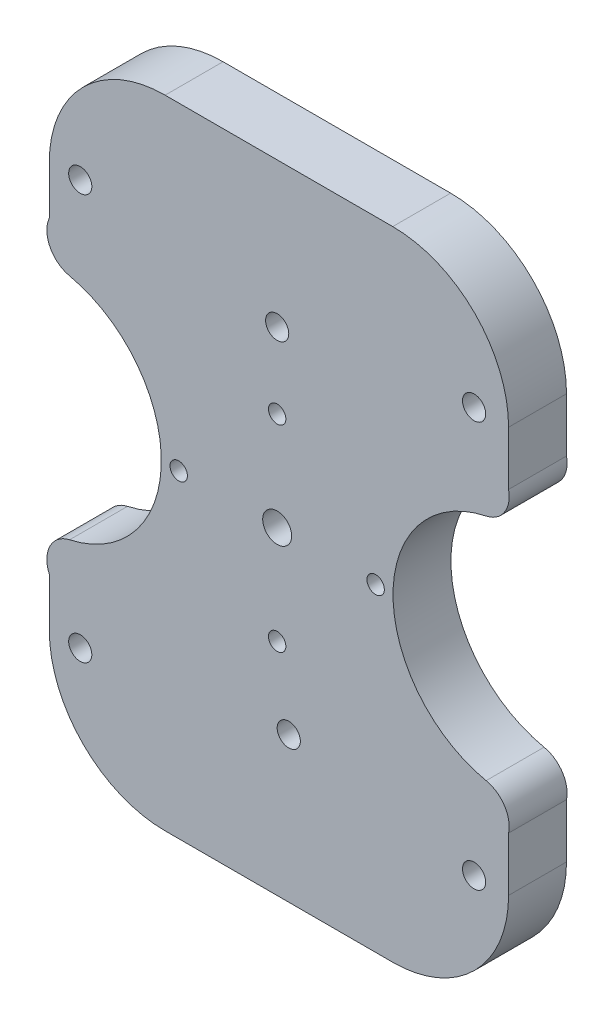
ISO-10303-21;
HEADER;
FILE_DESCRIPTION(('STEP AP214'),'2;1');
FILE_NAME('part.step','',(''),(''),'','','');
FILE_SCHEMA(('AUTOMOTIVE_DESIGN { 1 0 10303 214 1 1 1 1 }'));
ENDSEC;
DATA;
#1=APPLICATION_CONTEXT('core data for automotive mechanical design processes');
#2=APPLICATION_PROTOCOL_DEFINITION('international standard','automotive_design',2000,#1);
#3=PRODUCT_CONTEXT('',#1,'mechanical');
#4=PRODUCT('Part','Part','',(#3));
#5=PRODUCT_RELATED_PRODUCT_CATEGORY('part','',(#4));
#6=PRODUCT_DEFINITION_FORMATION('','',#4);
#7=PRODUCT_DEFINITION_CONTEXT('part definition',#1,'design');
#8=PRODUCT_DEFINITION('design','',#6,#7);
#9=PRODUCT_DEFINITION_SHAPE('','',#8);
#10=(LENGTH_UNIT() NAMED_UNIT(*) SI_UNIT(.MILLI.,.METRE.));
#11=(NAMED_UNIT(*) PLANE_ANGLE_UNIT() SI_UNIT($,.RADIAN.));
#12=(NAMED_UNIT(*) SI_UNIT($,.STERADIAN.) SOLID_ANGLE_UNIT());
#13=UNCERTAINTY_MEASURE_WITH_UNIT(LENGTH_MEASURE(1.E-05),#10,'distance_accuracy_value','');
#14=(GEOMETRIC_REPRESENTATION_CONTEXT(3) GLOBAL_UNCERTAINTY_ASSIGNED_CONTEXT((#13)) GLOBAL_UNIT_ASSIGNED_CONTEXT((#10,
#11,#12)) REPRESENTATION_CONTEXT('',''));
#15=CARTESIAN_POINT('',(0.,0.,0.));
#16=DIRECTION('',(0.,0.,1.));
#17=DIRECTION('',(1.,0.,0.));
#18=AXIS2_PLACEMENT_3D('',#15,#16,#17);
#19=CARTESIAN_POINT('',(0.,0.,10.));
#20=DIRECTION('',(0.,0.,1.));
#21=DIRECTION('',(1.,0.,0.));
#22=AXIS2_PLACEMENT_3D('',#19,#20,#21);
#23=PLANE('',#22);
#24=CARTESIAN_POINT('',(2.,-29.9332590941915,10.));
#25=DIRECTION('',(0.,0.,1.));
#26=DIRECTION('',(1.,0.,0.));
#27=AXIS2_PLACEMENT_3D('',#24,#25,#26);
#28=CIRCLE('',#27,2.);
#29=CARTESIAN_POINT('',(4.,-29.9332590941915,10.));
#30=VERTEX_POINT('',#29);
#31=EDGE_CURVE('E360',#30,#30,#28,.T.);
#32=ORIENTED_EDGE('',*,*,#31,.F.);
#33=EDGE_LOOP('',(#32));
#34=FACE_BOUND('',#33,.T.);
#35=CARTESIAN_POINT('',(0.,30.,10.));
#36=DIRECTION('',(0.,0.,1.));
#37=DIRECTION('',(1.,0.,0.));
#38=AXIS2_PLACEMENT_3D('',#35,#36,#37);
#39=CIRCLE('',#38,2.);
#40=CARTESIAN_POINT('',(2.,30.,10.));
#41=VERTEX_POINT('',#40);
#42=EDGE_CURVE('E352',#41,#41,#39,.T.);
#43=ORIENTED_EDGE('',*,*,#42,.F.);
#44=EDGE_LOOP('',(#43));
#45=FACE_BOUND('',#44,.T.);
#46=DIRECTION('',(0.,1.,0.));
#47=VECTOR('',#46,1.);
#48=CARTESIAN_POINT('',(-39.3415911875642,-55.,10.));
#49=LINE('',#48,#47);
#50=CARTESIAN_POINT('',(-39.3415911875641,-34.9999999999999,10.));
#51=VERTEX_POINT('',#50);
#52=CARTESIAN_POINT('',(-39.3415911875641,-26.6174604880063,10.));
#53=VERTEX_POINT('',#52);
#54=EDGE_CURVE('E265',#51,#53,#49,.T.);
#55=ORIENTED_EDGE('',*,*,#54,.F.);
#56=CARTESIAN_POINT('',(-19.3415911875641,-35.,10.));
#57=DIRECTION('',(0.,0.,1.));
#58=DIRECTION('',(1.,0.,0.));
#59=AXIS2_PLACEMENT_3D('',#56,#57,#58);
#60=CIRCLE('',#59,20.);
#61=CARTESIAN_POINT('',(-19.3415911875641,-55.,10.));
#62=VERTEX_POINT('',#61);
#63=EDGE_CURVE('E227',#51,#62,#60,.T.);
#64=ORIENTED_EDGE('',*,*,#63,.T.);
#65=DIRECTION('',(-1.,0.,0.));
#66=VECTOR('',#65,1.);
#67=CARTESIAN_POINT('',(39.9532882596949,-55.,10.));
#68=LINE('',#67,#66);
#69=CARTESIAN_POINT('',(19.9532882596949,-55.,10.));
#70=VERTEX_POINT('',#69);
#71=EDGE_CURVE('E318',#70,#62,#68,.T.);
#72=ORIENTED_EDGE('',*,*,#71,.F.);
#73=CARTESIAN_POINT('',(19.9532882596949,-35.,10.));
#74=DIRECTION('',(0.,0.,1.));
#75=DIRECTION('',(1.,0.,0.));
#76=AXIS2_PLACEMENT_3D('',#73,#74,#75);
#77=CIRCLE('',#76,20.);
#78=CARTESIAN_POINT('',(39.9532882596949,-35.,10.));
#79=VERTEX_POINT('',#78);
#80=EDGE_CURVE('E50',#70,#79,#77,.T.);
#81=ORIENTED_EDGE('',*,*,#80,.T.);
#82=DIRECTION('',(0.,-1.,0.));
#83=VECTOR('',#82,1.);
#84=CARTESIAN_POINT('',(39.9532882596949,-55.,10.));
#85=LINE('',#84,#83);
#86=CARTESIAN_POINT('',(39.9532882596949,-25.690168493759,10.));
#87=VERTEX_POINT('',#86);
#88=EDGE_CURVE('E315',#87,#79,#85,.T.);
#89=ORIENTED_EDGE('',*,*,#88,.F.);
#90=CARTESIAN_POINT('',(35.0575079692606,-24.6746216716997,10.));
#91=DIRECTION('',(0.,0.,1.));
#92=DIRECTION('',(1.,0.,0.));
#93=AXIS2_PLACEMENT_3D('',#90,#91,#92);
#94=CIRCLE('',#93,5.);
#95=CARTESIAN_POINT('',(36.0787968615845,-19.7800359897021,10.));
#96=VERTEX_POINT('',#95);
#97=EDGE_CURVE('E177',#87,#96,#94,.T.);
#98=ORIENTED_EDGE('',*,*,#97,.T.);
#99=CARTESIAN_POINT('',(40.2060371140847,0.,10.));
#100=DIRECTION('',(0.,0.,1.));
#101=DIRECTION('',(1.,0.,0.));
#102=AXIS2_PLACEMENT_3D('',#99,#100,#101);
#103=CIRCLE('',#102,20.2060371140847);
#104=CARTESIAN_POINT('',(36.0787968615846,19.7800359897021,10.));
#105=VERTEX_POINT('',#104);
#106=EDGE_CURVE('E345',#105,#96,#103,.T.);
#107=ORIENTED_EDGE('',*,*,#106,.F.);
#108=CARTESIAN_POINT('',(35.0575079692606,24.6746216716997,10.));
#109=DIRECTION('',(0.,0.,1.));
#110=DIRECTION('',(1.,0.,0.));
#111=AXIS2_PLACEMENT_3D('',#108,#109,#110);
#112=CIRCLE('',#111,5.);
#113=CARTESIAN_POINT('',(39.9532882596949,25.690168493759,10.));
#114=VERTEX_POINT('',#113);
#115=EDGE_CURVE('E196',#105,#114,#112,.T.);
#116=ORIENTED_EDGE('',*,*,#115,.T.);
#117=DIRECTION('',(0.,-1.,0.));
#118=VECTOR('',#117,1.);
#119=CARTESIAN_POINT('',(39.9532882596949,55.,10.));
#120=LINE('',#119,#118);
#121=CARTESIAN_POINT('',(39.9532882596949,35.,10.));
#122=VERTEX_POINT('',#121);
#123=EDGE_CURVE('E240',#122,#114,#120,.T.);
#124=ORIENTED_EDGE('',*,*,#123,.F.);
#125=CARTESIAN_POINT('',(19.9532882596949,35.,10.));
#126=DIRECTION('',(0.,0.,1.));
#127=DIRECTION('',(1.,0.,0.));
#128=AXIS2_PLACEMENT_3D('',#125,#126,#127);
#129=CIRCLE('',#128,20.);
#130=CARTESIAN_POINT('',(19.9532882596949,55.,10.));
#131=VERTEX_POINT('',#130);
#132=EDGE_CURVE('E224',#122,#131,#129,.T.);
#133=ORIENTED_EDGE('',*,*,#132,.T.);
#134=DIRECTION('',(1.,0.,0.));
#135=VECTOR('',#134,1.);
#136=CARTESIAN_POINT('',(39.9532882596949,55.,10.));
#137=LINE('',#136,#135);
#138=CARTESIAN_POINT('',(-19.3415911875642,55.,10.));
#139=VERTEX_POINT('',#138);
#140=EDGE_CURVE('E250',#139,#131,#137,.T.);
#141=ORIENTED_EDGE('',*,*,#140,.F.);
#142=CARTESIAN_POINT('',(-19.3415911875642,35.,10.));
#143=DIRECTION('',(0.,0.,1.));
#144=DIRECTION('',(1.,0.,0.));
#145=AXIS2_PLACEMENT_3D('',#142,#143,#144);
#146=CIRCLE('',#145,20.);
#147=CARTESIAN_POINT('',(-39.3415911875642,35.,10.));
#148=VERTEX_POINT('',#147);
#149=EDGE_CURVE('E57',#139,#148,#146,.T.);
#150=ORIENTED_EDGE('',*,*,#149,.T.);
#151=DIRECTION('',(0.,1.,0.));
#152=VECTOR('',#151,1.);
#153=CARTESIAN_POINT('',(-39.3415911875642,55.,10.));
#154=LINE('',#153,#152);
#155=CARTESIAN_POINT('',(-39.3415911875642,26.6174604880063,10.));
#156=VERTEX_POINT('',#155);
#157=EDGE_CURVE('E263',#156,#148,#154,.T.);
#158=ORIENTED_EDGE('',*,*,#157,.F.);
#159=CARTESIAN_POINT('',(-34.7618104074789,24.6110687001539,10.));
#160=DIRECTION('',(0.,0.,1.));
#161=DIRECTION('',(1.,0.,0.));
#162=AXIS2_PLACEMENT_3D('',#159,#160,#161);
#163=CIRCLE('',#162,5.);
#164=CARTESIAN_POINT('',(-35.8417553988246,19.7290897145716,10.));
#165=VERTEX_POINT('',#164);
#166=EDGE_CURVE('E190',#156,#165,#163,.T.);
#167=ORIENTED_EDGE('',*,*,#166,.T.);
#168=CARTESIAN_POINT('',(-40.2060371140847,0.,10.));
#169=DIRECTION('',(0.,0.,1.));
#170=DIRECTION('',(-1.,0.,0.));
#171=AXIS2_PLACEMENT_3D('',#168,#169,#170);
#172=CIRCLE('',#171,20.2060371140847);
#173=CARTESIAN_POINT('',(-35.8417553988246,-19.7290897145716,10.));
#174=VERTEX_POINT('',#173);
#175=EDGE_CURVE('E350',#174,#165,#172,.T.);
#176=ORIENTED_EDGE('',*,*,#175,.F.);
#177=CARTESIAN_POINT('',(-34.7618104074789,-24.6110687001539,10.));
#178=DIRECTION('',(0.,0.,1.));
#179=DIRECTION('',(1.,0.,0.));
#180=AXIS2_PLACEMENT_3D('',#177,#178,#179);
#181=CIRCLE('',#180,5.);
#182=EDGE_CURVE('E192',#174,#53,#181,.T.);
#183=ORIENTED_EDGE('',*,*,#182,.T.);
#184=EDGE_LOOP('',(#55,#64,#72,#81,#89,#98,#107,#116,#124,#133,#141,#150,#158,#167,#176,#183));
#185=FACE_BOUND('',#184,.T.);
#186=CARTESIAN_POINT('',(34.,-35.,10.));
#187=DIRECTION('',(0.,0.,-1.));
#188=DIRECTION('',(1.,0.,0.));
#189=AXIS2_PLACEMENT_3D('',#186,#187,#188);
#190=CIRCLE('',#189,2.);
#191=CARTESIAN_POINT('',(36.,-35.,10.));
#192=VERTEX_POINT('',#191);
#193=EDGE_CURVE('E340',#192,#192,#190,.T.);
#194=ORIENTED_EDGE('',*,*,#193,.T.);
#195=EDGE_LOOP('',(#194));
#196=FACE_BOUND('',#195,.T.);
#197=CARTESIAN_POINT('',(-34.,-35.,10.));
#198=DIRECTION('',(0.,0.,-1.));
#199=DIRECTION('',(1.,0.,0.));
#200=AXIS2_PLACEMENT_3D('',#197,#198,#199);
#201=CIRCLE('',#200,2.);
#202=CARTESIAN_POINT('',(-32.,-35.,10.));
#203=VERTEX_POINT('',#202);
#204=EDGE_CURVE('E334',#203,#203,#201,.T.);
#205=ORIENTED_EDGE('',*,*,#204,.T.);
#206=EDGE_LOOP('',(#205));
#207=FACE_BOUND('',#206,.T.);
#208=CARTESIAN_POINT('',(34.,35.,10.));
#209=DIRECTION('',(0.,0.,1.));
#210=DIRECTION('',(1.,0.,0.));
#211=AXIS2_PLACEMENT_3D('',#208,#209,#210);
#212=CIRCLE('',#211,2.);
#213=CARTESIAN_POINT('',(36.,35.,10.));
#214=VERTEX_POINT('',#213);
#215=EDGE_CURVE('E328',#214,#214,#212,.T.);
#216=ORIENTED_EDGE('',*,*,#215,.F.);
#217=EDGE_LOOP('',(#216));
#218=FACE_BOUND('',#217,.T.);
#219=CARTESIAN_POINT('',(-34.,35.,10.));
#220=DIRECTION('',(0.,0.,1.));
#221=DIRECTION('',(1.,0.,0.));
#222=AXIS2_PLACEMENT_3D('',#219,#220,#221);
#223=CIRCLE('',#222,2.);
#224=CARTESIAN_POINT('',(-32.,35.,10.));
#225=VERTEX_POINT('',#224);
#226=EDGE_CURVE('E322',#225,#225,#223,.T.);
#227=ORIENTED_EDGE('',*,*,#226,.F.);
#228=EDGE_LOOP('',(#227));
#229=FACE_BOUND('',#228,.T.);
#230=CARTESIAN_POINT('',(0.,-17.,10.));
#231=DIRECTION('',(0.,0.,1.));
#232=DIRECTION('',(1.,0.,0.));
#233=AXIS2_PLACEMENT_3D('',#230,#231,#232);
#234=CIRCLE('',#233,1.5);
#235=CARTESIAN_POINT('',(1.50000000000001,-17.,10.));
#236=VERTEX_POINT('',#235);
#237=EDGE_CURVE('E274',#236,#236,#234,.T.);
#238=ORIENTED_EDGE('',*,*,#237,.F.);
#239=EDGE_LOOP('',(#238));
#240=FACE_BOUND('',#239,.T.);
#241=CARTESIAN_POINT('',(0.,17.,10.));
#242=DIRECTION('',(0.,0.,1.));
#243=DIRECTION('',(1.,0.,0.));
#244=AXIS2_PLACEMENT_3D('',#241,#242,#243);
#245=CIRCLE('',#244,1.5);
#246=CARTESIAN_POINT('',(1.50000000000001,17.,10.));
#247=VERTEX_POINT('',#246);
#248=EDGE_CURVE('E286',#247,#247,#245,.T.);
#249=ORIENTED_EDGE('',*,*,#248,.F.);
#250=EDGE_LOOP('',(#249));
#251=FACE_BOUND('',#250,.T.);
#252=CARTESIAN_POINT('',(0.,0.,10.));
#253=DIRECTION('',(0.,0.,1.));
#254=DIRECTION('',(1.,0.,0.));
#255=AXIS2_PLACEMENT_3D('',#252,#253,#254);
#256=CIRCLE('',#255,2.5);
#257=CARTESIAN_POINT('',(2.5,0.,10.));
#258=VERTEX_POINT('',#257);
#259=EDGE_CURVE('E292',#258,#258,#256,.T.);
#260=ORIENTED_EDGE('',*,*,#259,.F.);
#261=EDGE_LOOP('',(#260));
#262=FACE_BOUND('',#261,.T.);
#263=CARTESIAN_POINT('',(17.,0.,10.));
#264=DIRECTION('',(0.,0.,1.));
#265=DIRECTION('',(1.,0.,0.));
#266=AXIS2_PLACEMENT_3D('',#263,#264,#265);
#267=CIRCLE('',#266,1.5);
#268=CARTESIAN_POINT('',(18.5,0.,10.));
#269=VERTEX_POINT('',#268);
#270=EDGE_CURVE('E280',#269,#269,#267,.T.);
#271=ORIENTED_EDGE('',*,*,#270,.F.);
#272=EDGE_LOOP('',(#271));
#273=FACE_BOUND('',#272,.T.);
#274=CARTESIAN_POINT('',(-17.,0.,10.));
#275=DIRECTION('',(0.,0.,1.));
#276=DIRECTION('',(1.,0.,0.));
#277=AXIS2_PLACEMENT_3D('',#274,#275,#276);
#278=CIRCLE('',#277,1.5);
#279=CARTESIAN_POINT('',(-15.5,0.,10.));
#280=VERTEX_POINT('',#279);
#281=EDGE_CURVE('E268',#280,#280,#278,.T.);
#282=ORIENTED_EDGE('',*,*,#281,.F.);
#283=EDGE_LOOP('',(#282));
#284=FACE_BOUND('',#283,.T.);
#285=ADVANCED_FACE('F35',(#34,#45,#185,#196,#207,#218,#229,#240,#251,#262,#273,#284),#23,.T.);
#286=CARTESIAN_POINT('',(0.,0.,0.));
#287=DIRECTION('',(0.,0.,1.));
#288=DIRECTION('',(1.,0.,0.));
#289=AXIS2_PLACEMENT_3D('',#286,#287,#288);
#290=PLANE('',#289);
#291=CARTESIAN_POINT('',(2.,-29.9332590941915,0.));
#292=DIRECTION('',(0.,0.,-1.));
#293=DIRECTION('',(-1.,0.,0.));
#294=AXIS2_PLACEMENT_3D('',#291,#292,#293);
#295=CIRCLE('',#294,2.);
#296=CARTESIAN_POINT('',(0.,-29.9332590941915,0.));
#297=VERTEX_POINT('',#296);
#298=EDGE_CURVE('E363',#297,#297,#295,.T.);
#299=ORIENTED_EDGE('',*,*,#298,.F.);
#300=EDGE_LOOP('',(#299));
#301=FACE_BOUND('',#300,.T.);
#302=CARTESIAN_POINT('',(0.,30.,0.));
#303=DIRECTION('',(0.,0.,-1.));
#304=DIRECTION('',(-1.,0.,0.));
#305=AXIS2_PLACEMENT_3D('',#302,#303,#304);
#306=CIRCLE('',#305,2.);
#307=CARTESIAN_POINT('',(-2.,30.,0.));
#308=VERTEX_POINT('',#307);
#309=EDGE_CURVE('E357',#308,#308,#306,.T.);
#310=ORIENTED_EDGE('',*,*,#309,.F.);
#311=EDGE_LOOP('',(#310));
#312=FACE_BOUND('',#311,.T.);
#313=CARTESIAN_POINT('',(34.,-35.,0.));
#314=DIRECTION('',(0.,0.,-1.));
#315=DIRECTION('',(1.,0.,0.));
#316=AXIS2_PLACEMENT_3D('',#313,#314,#315);
#317=CIRCLE('',#316,2.);
#318=CARTESIAN_POINT('',(36.,-35.,0.));
#319=VERTEX_POINT('',#318);
#320=EDGE_CURVE('E337',#319,#319,#317,.T.);
#321=ORIENTED_EDGE('',*,*,#320,.F.);
#322=EDGE_LOOP('',(#321));
#323=FACE_BOUND('',#322,.T.);
#324=CARTESIAN_POINT('',(-34.,-35.,0.));
#325=DIRECTION('',(0.,0.,-1.));
#326=DIRECTION('',(1.,0.,0.));
#327=AXIS2_PLACEMENT_3D('',#324,#325,#326);
#328=CIRCLE('',#327,2.);
#329=CARTESIAN_POINT('',(-32.,-35.,0.));
#330=VERTEX_POINT('',#329);
#331=EDGE_CURVE('E331',#330,#330,#328,.T.);
#332=ORIENTED_EDGE('',*,*,#331,.F.);
#333=EDGE_LOOP('',(#332));
#334=FACE_BOUND('',#333,.T.);
#335=CARTESIAN_POINT('',(34.,35.,0.));
#336=DIRECTION('',(0.,0.,1.));
#337=DIRECTION('',(1.,0.,0.));
#338=AXIS2_PLACEMENT_3D('',#335,#336,#337);
#339=CIRCLE('',#338,2.);
#340=CARTESIAN_POINT('',(36.,35.,0.));
#341=VERTEX_POINT('',#340);
#342=EDGE_CURVE('E325',#341,#341,#339,.T.);
#343=ORIENTED_EDGE('',*,*,#342,.T.);
#344=EDGE_LOOP('',(#343));
#345=FACE_BOUND('',#344,.T.);
#346=CARTESIAN_POINT('',(-34.,35.,0.));
#347=DIRECTION('',(0.,0.,1.));
#348=DIRECTION('',(1.,0.,0.));
#349=AXIS2_PLACEMENT_3D('',#346,#347,#348);
#350=CIRCLE('',#349,2.);
#351=CARTESIAN_POINT('',(-32.,35.,0.));
#352=VERTEX_POINT('',#351);
#353=EDGE_CURVE('E174',#352,#352,#350,.T.);
#354=ORIENTED_EDGE('',*,*,#353,.T.);
#355=EDGE_LOOP('',(#354));
#356=FACE_BOUND('',#355,.T.);
#357=DIRECTION('',(-1.,0.,0.));
#358=VECTOR('',#357,1.);
#359=CARTESIAN_POINT('',(39.9532882596949,-55.,0.));
#360=LINE('',#359,#358);
#361=CARTESIAN_POINT('',(19.9532882596949,-55.,0.));
#362=VERTEX_POINT('',#361);
#363=CARTESIAN_POINT('',(-19.3415911875641,-55.,0.));
#364=VERTEX_POINT('',#363);
#365=EDGE_CURVE('E173',#362,#364,#360,.T.);
#366=ORIENTED_EDGE('',*,*,#365,.T.);
#367=CARTESIAN_POINT('',(-19.3415911875641,-35.,0.));
#368=DIRECTION('',(0.,0.,1.));
#369=DIRECTION('',(1.,0.,0.));
#370=AXIS2_PLACEMENT_3D('',#367,#368,#369);
#371=CIRCLE('',#370,20.);
#372=CARTESIAN_POINT('',(-39.3415911875641,-34.9999999999999,0.));
#373=VERTEX_POINT('',#372);
#374=EDGE_CURVE('E219',#364,#373,#371,.F.);
#375=ORIENTED_EDGE('',*,*,#374,.T.);
#376=DIRECTION('',(0.,1.,0.));
#377=VECTOR('',#376,1.);
#378=CARTESIAN_POINT('',(-39.3415911875642,-55.,0.));
#379=LINE('',#378,#377);
#380=CARTESIAN_POINT('',(-39.3415911875641,-26.6174604880063,0.));
#381=VERTEX_POINT('',#380);
#382=EDGE_CURVE('E313',#373,#381,#379,.T.);
#383=ORIENTED_EDGE('',*,*,#382,.T.);
#384=CARTESIAN_POINT('',(-34.7618104074789,-24.6110687001539,0.));
#385=DIRECTION('',(0.,0.,1.));
#386=DIRECTION('',(1.,0.,0.));
#387=AXIS2_PLACEMENT_3D('',#384,#385,#386);
#388=CIRCLE('',#387,5.);
#389=CARTESIAN_POINT('',(-35.8417553988246,-19.7290897145716,0.));
#390=VERTEX_POINT('',#389);
#391=EDGE_CURVE('E164',#381,#390,#388,.F.);
#392=ORIENTED_EDGE('',*,*,#391,.T.);
#393=CARTESIAN_POINT('',(-40.2060371140847,0.,0.));
#394=DIRECTION('',(0.,0.,1.));
#395=DIRECTION('',(-1.,0.,0.));
#396=AXIS2_PLACEMENT_3D('',#393,#394,#395);
#397=CIRCLE('',#396,20.2060371140847);
#398=CARTESIAN_POINT('',(-35.8417553988246,19.7290897145716,0.));
#399=VERTEX_POINT('',#398);
#400=EDGE_CURVE('E348',#390,#399,#397,.T.);
#401=ORIENTED_EDGE('',*,*,#400,.T.);
#402=CARTESIAN_POINT('',(-34.7618104074789,24.6110687001539,0.));
#403=DIRECTION('',(0.,0.,1.));
#404=DIRECTION('',(1.,0.,0.));
#405=AXIS2_PLACEMENT_3D('',#402,#403,#404);
#406=CIRCLE('',#405,5.);
#407=CARTESIAN_POINT('',(-39.3415911875642,26.6174604880063,0.));
#408=VERTEX_POINT('',#407);
#409=EDGE_CURVE('E199',#399,#408,#406,.F.);
#410=ORIENTED_EDGE('',*,*,#409,.T.);
#411=DIRECTION('',(0.,1.,0.));
#412=VECTOR('',#411,1.);
#413=CARTESIAN_POINT('',(-39.3415911875642,55.,0.));
#414=LINE('',#413,#412);
#415=CARTESIAN_POINT('',(-39.3415911875642,35.,0.));
#416=VERTEX_POINT('',#415);
#417=EDGE_CURVE('E261',#408,#416,#414,.T.);
#418=ORIENTED_EDGE('',*,*,#417,.T.);
#419=CARTESIAN_POINT('',(-19.3415911875642,35.,0.));
#420=DIRECTION('',(0.,0.,1.));
#421=DIRECTION('',(1.,0.,0.));
#422=AXIS2_PLACEMENT_3D('',#419,#420,#421);
#423=CIRCLE('',#422,20.);
#424=CARTESIAN_POINT('',(-19.3415911875642,55.,0.));
#425=VERTEX_POINT('',#424);
#426=EDGE_CURVE('E213',#416,#425,#423,.F.);
#427=ORIENTED_EDGE('',*,*,#426,.T.);
#428=DIRECTION('',(1.,0.,0.));
#429=VECTOR('',#428,1.);
#430=CARTESIAN_POINT('',(39.9532882596949,55.,0.));
#431=LINE('',#430,#429);
#432=CARTESIAN_POINT('',(19.9532882596949,55.,0.));
#433=VERTEX_POINT('',#432);
#434=EDGE_CURVE('E258',#425,#433,#431,.T.);
#435=ORIENTED_EDGE('',*,*,#434,.T.);
#436=CARTESIAN_POINT('',(19.9532882596949,35.,0.));
#437=DIRECTION('',(0.,0.,1.));
#438=DIRECTION('',(1.,0.,0.));
#439=AXIS2_PLACEMENT_3D('',#436,#437,#438);
#440=CIRCLE('',#439,20.);
#441=CARTESIAN_POINT('',(39.9532882596949,35.,0.));
#442=VERTEX_POINT('',#441);
#443=EDGE_CURVE('E215',#433,#442,#440,.F.);
#444=ORIENTED_EDGE('',*,*,#443,.T.);
#445=DIRECTION('',(0.,-1.,0.));
#446=VECTOR('',#445,1.);
#447=CARTESIAN_POINT('',(39.9532882596949,55.,0.));
#448=LINE('',#447,#446);
#449=CARTESIAN_POINT('',(39.9532882596949,25.690168493759,0.));
#450=VERTEX_POINT('',#449);
#451=EDGE_CURVE('E241',#442,#450,#448,.T.);
#452=ORIENTED_EDGE('',*,*,#451,.T.);
#453=CARTESIAN_POINT('',(35.0575079692606,24.6746216716997,0.));
#454=DIRECTION('',(0.,0.,1.));
#455=DIRECTION('',(1.,0.,0.));
#456=AXIS2_PLACEMENT_3D('',#453,#454,#455);
#457=CIRCLE('',#456,5.);
#458=CARTESIAN_POINT('',(36.0787968615846,19.7800359897021,0.));
#459=VERTEX_POINT('',#458);
#460=EDGE_CURVE('E163',#450,#459,#457,.F.);
#461=ORIENTED_EDGE('',*,*,#460,.T.);
#462=CARTESIAN_POINT('',(40.2060371140847,0.,0.));
#463=DIRECTION('',(0.,0.,1.));
#464=DIRECTION('',(1.,0.,0.));
#465=AXIS2_PLACEMENT_3D('',#462,#463,#464);
#466=CIRCLE('',#465,20.2060371140847);
#467=CARTESIAN_POINT('',(36.0787968615845,-19.7800359897021,0.));
#468=VERTEX_POINT('',#467);
#469=EDGE_CURVE('E159',#459,#468,#466,.T.);
#470=ORIENTED_EDGE('',*,*,#469,.T.);
#471=CARTESIAN_POINT('',(35.0575079692606,-24.6746216716997,0.));
#472=DIRECTION('',(0.,0.,1.));
#473=DIRECTION('',(1.,0.,0.));
#474=AXIS2_PLACEMENT_3D('',#471,#472,#473);
#475=CIRCLE('',#474,5.);
#476=CARTESIAN_POINT('',(39.9532882596949,-25.690168493759,0.));
#477=VERTEX_POINT('',#476);
#478=EDGE_CURVE('E152',#468,#477,#475,.F.);
#479=ORIENTED_EDGE('',*,*,#478,.T.);
#480=DIRECTION('',(0.,-1.,0.));
#481=VECTOR('',#480,1.);
#482=CARTESIAN_POINT('',(39.9532882596949,-55.,0.));
#483=LINE('',#482,#481);
#484=CARTESIAN_POINT('',(39.9532882596949,-35.,0.));
#485=VERTEX_POINT('',#484);
#486=EDGE_CURVE('E157',#477,#485,#483,.T.);
#487=ORIENTED_EDGE('',*,*,#486,.T.);
#488=CARTESIAN_POINT('',(19.9532882596949,-35.,0.));
#489=DIRECTION('',(0.,0.,1.));
#490=DIRECTION('',(1.,0.,0.));
#491=AXIS2_PLACEMENT_3D('',#488,#489,#490);
#492=CIRCLE('',#491,20.);
#493=EDGE_CURVE('E217',#485,#362,#492,.F.);
#494=ORIENTED_EDGE('',*,*,#493,.T.);
#495=EDGE_LOOP('',(#366,#375,#383,#392,#401,#410,#418,#427,#435,#444,#452,#461,#470,#479,#487,#494));
#496=FACE_BOUND('',#495,.T.);
#497=CARTESIAN_POINT('',(0.,0.,0.));
#498=DIRECTION('',(0.,0.,1.));
#499=DIRECTION('',(1.,0.,0.));
#500=AXIS2_PLACEMENT_3D('',#497,#498,#499);
#501=CIRCLE('',#500,2.5);
#502=CARTESIAN_POINT('',(2.5,0.,0.));
#503=VERTEX_POINT('',#502);
#504=EDGE_CURVE('E289',#503,#503,#501,.T.);
#505=ORIENTED_EDGE('',*,*,#504,.T.);
#506=EDGE_LOOP('',(#505));
#507=FACE_BOUND('',#506,.T.);
#508=CARTESIAN_POINT('',(0.,17.,0.));
#509=DIRECTION('',(0.,0.,1.));
#510=DIRECTION('',(1.,0.,0.));
#511=AXIS2_PLACEMENT_3D('',#508,#509,#510);
#512=CIRCLE('',#511,1.5);
#513=CARTESIAN_POINT('',(1.50000000000001,17.,0.));
#514=VERTEX_POINT('',#513);
#515=EDGE_CURVE('E283',#514,#514,#512,.T.);
#516=ORIENTED_EDGE('',*,*,#515,.T.);
#517=EDGE_LOOP('',(#516));
#518=FACE_BOUND('',#517,.T.);
#519=CARTESIAN_POINT('',(17.,0.,0.));
#520=DIRECTION('',(0.,0.,1.));
#521=DIRECTION('',(1.,0.,0.));
#522=AXIS2_PLACEMENT_3D('',#519,#520,#521);
#523=CIRCLE('',#522,1.5);
#524=CARTESIAN_POINT('',(18.5,0.,0.));
#525=VERTEX_POINT('',#524);
#526=EDGE_CURVE('E277',#525,#525,#523,.T.);
#527=ORIENTED_EDGE('',*,*,#526,.T.);
#528=EDGE_LOOP('',(#527));
#529=FACE_BOUND('',#528,.T.);
#530=CARTESIAN_POINT('',(0.,-17.,0.));
#531=DIRECTION('',(0.,0.,1.));
#532=DIRECTION('',(1.,0.,0.));
#533=AXIS2_PLACEMENT_3D('',#530,#531,#532);
#534=CIRCLE('',#533,1.5);
#535=CARTESIAN_POINT('',(1.50000000000001,-17.,0.));
#536=VERTEX_POINT('',#535);
#537=EDGE_CURVE('E271',#536,#536,#534,.T.);
#538=ORIENTED_EDGE('',*,*,#537,.T.);
#539=EDGE_LOOP('',(#538));
#540=FACE_BOUND('',#539,.T.);
#541=CARTESIAN_POINT('',(-17.,0.,0.));
#542=DIRECTION('',(0.,0.,1.));
#543=DIRECTION('',(1.,0.,0.));
#544=AXIS2_PLACEMENT_3D('',#541,#542,#543);
#545=CIRCLE('',#544,1.5);
#546=CARTESIAN_POINT('',(-15.5,0.,0.));
#547=VERTEX_POINT('',#546);
#548=EDGE_CURVE('E249',#547,#547,#545,.T.);
#549=ORIENTED_EDGE('',*,*,#548,.T.);
#550=EDGE_LOOP('',(#549));
#551=FACE_BOUND('',#550,.T.);
#552=ADVANCED_FACE('F155',(#301,#312,#323,#334,#345,#356,#496,#507,#518,#529,#540,#551),#290,.F.);
#553=CARTESIAN_POINT('',(0.,0.,10.));
#554=DIRECTION('',(0.,0.,-1.));
#555=DIRECTION('',(-1.,0.,0.));
#556=AXIS2_PLACEMENT_3D('',#553,#554,#555);
#557=CYLINDRICAL_SURFACE('',#556,2.5);
#558=ORIENTED_EDGE('',*,*,#259,.T.);
#559=EDGE_LOOP('',(#558));
#560=FACE_BOUND('',#559,.T.);
#561=ORIENTED_EDGE('',*,*,#504,.F.);
#562=EDGE_LOOP('',(#561));
#563=FACE_BOUND('',#562,.T.);
#564=ADVANCED_FACE('F371',(#560,#563),#557,.F.);
#565=CARTESIAN_POINT('',(0.,17.,10.));
#566=DIRECTION('',(0.,0.,-1.));
#567=DIRECTION('',(-1.,0.,0.));
#568=AXIS2_PLACEMENT_3D('',#565,#566,#567);
#569=CYLINDRICAL_SURFACE('',#568,1.5);
#570=ORIENTED_EDGE('',*,*,#248,.T.);
#571=EDGE_LOOP('',(#570));
#572=FACE_BOUND('',#571,.T.);
#573=ORIENTED_EDGE('',*,*,#515,.F.);
#574=EDGE_LOOP('',(#573));
#575=FACE_BOUND('',#574,.T.);
#576=ADVANCED_FACE('F424',(#572,#575),#569,.F.);
#577=CARTESIAN_POINT('',(17.,0.,10.));
#578=DIRECTION('',(0.,0.,-1.));
#579=DIRECTION('',(-1.,0.,0.));
#580=AXIS2_PLACEMENT_3D('',#577,#578,#579);
#581=CYLINDRICAL_SURFACE('',#580,1.5);
#582=ORIENTED_EDGE('',*,*,#270,.T.);
#583=EDGE_LOOP('',(#582));
#584=FACE_BOUND('',#583,.T.);
#585=ORIENTED_EDGE('',*,*,#526,.F.);
#586=EDGE_LOOP('',(#585));
#587=FACE_BOUND('',#586,.T.);
#588=ADVANCED_FACE('F417',(#584,#587),#581,.F.);
#589=CARTESIAN_POINT('',(0.,-17.,10.));
#590=DIRECTION('',(0.,0.,-1.));
#591=DIRECTION('',(-1.,0.,0.));
#592=AXIS2_PLACEMENT_3D('',#589,#590,#591);
#593=CYLINDRICAL_SURFACE('',#592,1.5);
#594=ORIENTED_EDGE('',*,*,#237,.T.);
#595=EDGE_LOOP('',(#594));
#596=FACE_BOUND('',#595,.T.);
#597=ORIENTED_EDGE('',*,*,#537,.F.);
#598=EDGE_LOOP('',(#597));
#599=FACE_BOUND('',#598,.T.);
#600=ADVANCED_FACE('F408',(#596,#599),#593,.F.);
#601=CARTESIAN_POINT('',(-17.,0.,10.));
#602=DIRECTION('',(0.,0.,-1.));
#603=DIRECTION('',(-1.,0.,0.));
#604=AXIS2_PLACEMENT_3D('',#601,#602,#603);
#605=CYLINDRICAL_SURFACE('',#604,1.5);
#606=ORIENTED_EDGE('',*,*,#281,.T.);
#607=EDGE_LOOP('',(#606));
#608=FACE_BOUND('',#607,.T.);
#609=ORIENTED_EDGE('',*,*,#548,.F.);
#610=EDGE_LOOP('',(#609));
#611=FACE_BOUND('',#610,.T.);
#612=ADVANCED_FACE('F405',(#608,#611),#605,.F.);
#613=CARTESIAN_POINT('',(-39.3415911875642,55.,10.));
#614=DIRECTION('',(-1.,0.,0.));
#615=DIRECTION('',(0.,0.,1.));
#616=AXIS2_PLACEMENT_3D('',#613,#614,#615);
#617=PLANE('',#616);
#618=ORIENTED_EDGE('',*,*,#157,.T.);
#619=DIRECTION('',(0.,0.,-1.));
#620=VECTOR('',#619,1.);
#621=CARTESIAN_POINT('',(-39.3415911875642,35.,10.));
#622=LINE('',#621,#620);
#623=EDGE_CURVE('E12',#148,#416,#622,.T.);
#624=ORIENTED_EDGE('',*,*,#623,.T.);
#625=ORIENTED_EDGE('',*,*,#417,.F.);
#626=DIRECTION('',(0.,0.,-1.));
#627=VECTOR('',#626,1.);
#628=CARTESIAN_POINT('',(-39.3415911875642,26.6174604880063,10.));
#629=LINE('',#628,#627);
#630=EDGE_CURVE('E184',#156,#408,#629,.T.);
#631=ORIENTED_EDGE('',*,*,#630,.F.);
#632=EDGE_LOOP('',(#618,#624,#625,#631));
#633=FACE_BOUND('',#632,.T.);
#634=ADVANCED_FACE('F306',(#633),#617,.T.);
#635=CARTESIAN_POINT('',(39.9532882596949,55.,10.));
#636=DIRECTION('',(1.,0.,0.));
#637=DIRECTION('',(0.,1.,0.));
#638=AXIS2_PLACEMENT_3D('',#635,#636,#637);
#639=PLANE('',#638);
#640=ORIENTED_EDGE('',*,*,#451,.F.);
#641=DIRECTION('',(0.,0.,-1.));
#642=VECTOR('',#641,1.);
#643=CARTESIAN_POINT('',(39.9532882596949,35.,10.));
#644=LINE('',#643,#642);
#645=EDGE_CURVE('E43',#442,#122,#644,.F.);
#646=ORIENTED_EDGE('',*,*,#645,.T.);
#647=ORIENTED_EDGE('',*,*,#123,.T.);
#648=DIRECTION('',(0.,0.,-1.));
#649=VECTOR('',#648,1.);
#650=CARTESIAN_POINT('',(39.9532882596949,25.690168493759,10.));
#651=LINE('',#650,#649);
#652=EDGE_CURVE('E295',#450,#114,#651,.F.);
#653=ORIENTED_EDGE('',*,*,#652,.F.);
#654=EDGE_LOOP('',(#640,#646,#647,#653));
#655=FACE_BOUND('',#654,.T.);
#656=ADVANCED_FACE('F238',(#655),#639,.T.);
#657=CARTESIAN_POINT('',(39.9532882596949,55.,10.));
#658=DIRECTION('',(0.,1.,0.));
#659=DIRECTION('',(0.,0.,1.));
#660=AXIS2_PLACEMENT_3D('',#657,#658,#659);
#661=PLANE('',#660);
#662=ORIENTED_EDGE('',*,*,#140,.T.);
#663=DIRECTION('',(0.,0.,-1.));
#664=VECTOR('',#663,1.);
#665=CARTESIAN_POINT('',(19.9532882596949,55.,10.));
#666=LINE('',#665,#664);
#667=EDGE_CURVE('E232',#131,#433,#666,.T.);
#668=ORIENTED_EDGE('',*,*,#667,.T.);
#669=ORIENTED_EDGE('',*,*,#434,.F.);
#670=DIRECTION('',(0.,0.,-1.));
#671=VECTOR('',#670,1.);
#672=CARTESIAN_POINT('',(-19.3415911875642,55.,10.));
#673=LINE('',#672,#671);
#674=EDGE_CURVE('E230',#425,#139,#673,.F.);
#675=ORIENTED_EDGE('',*,*,#674,.T.);
#676=EDGE_LOOP('',(#662,#668,#669,#675));
#677=FACE_BOUND('',#676,.T.);
#678=ADVANCED_FACE('F257',(#677),#661,.T.);
#679=CARTESIAN_POINT('',(39.9532882596949,-55.,10.));
#680=DIRECTION('',(1.,0.,0.));
#681=DIRECTION('',(0.,0.,-1.));
#682=AXIS2_PLACEMENT_3D('',#679,#680,#681);
#683=PLANE('',#682);
#684=ORIENTED_EDGE('',*,*,#88,.T.);
#685=DIRECTION('',(0.,0.,-1.));
#686=VECTOR('',#685,1.);
#687=CARTESIAN_POINT('',(39.9532882596949,-35.,10.));
#688=LINE('',#687,#686);
#689=EDGE_CURVE('E172',#79,#485,#688,.T.);
#690=ORIENTED_EDGE('',*,*,#689,.T.);
#691=ORIENTED_EDGE('',*,*,#486,.F.);
#692=DIRECTION('',(0.,0.,-1.));
#693=VECTOR('',#692,1.);
#694=CARTESIAN_POINT('',(39.9532882596949,-25.690168493759,10.));
#695=LINE('',#694,#693);
#696=EDGE_CURVE('E170',#87,#477,#695,.T.);
#697=ORIENTED_EDGE('',*,*,#696,.F.);
#698=EDGE_LOOP('',(#684,#690,#691,#697));
#699=FACE_BOUND('',#698,.T.);
#700=ADVANCED_FACE('F169',(#699),#683,.T.);
#701=CARTESIAN_POINT('',(-39.3415911875642,-55.,10.));
#702=DIRECTION('',(-1.,0.,0.));
#703=DIRECTION('',(0.,-1.,0.));
#704=AXIS2_PLACEMENT_3D('',#701,#702,#703);
#705=PLANE('',#704);
#706=ORIENTED_EDGE('',*,*,#382,.F.);
#707=DIRECTION('',(0.,0.,-1.));
#708=VECTOR('',#707,1.);
#709=CARTESIAN_POINT('',(-39.3415911875641,-34.9999999999999,10.));
#710=LINE('',#709,#708);
#711=EDGE_CURVE('E221',#373,#51,#710,.F.);
#712=ORIENTED_EDGE('',*,*,#711,.T.);
#713=ORIENTED_EDGE('',*,*,#54,.T.);
#714=DIRECTION('',(0.,0.,-1.));
#715=VECTOR('',#714,1.);
#716=CARTESIAN_POINT('',(-39.3415911875641,-26.6174604880063,10.));
#717=LINE('',#716,#715);
#718=EDGE_CURVE('E179',#381,#53,#717,.F.);
#719=ORIENTED_EDGE('',*,*,#718,.F.);
#720=EDGE_LOOP('',(#706,#712,#713,#719));
#721=FACE_BOUND('',#720,.T.);
#722=ADVANCED_FACE('F476',(#721),#705,.T.);
#723=CARTESIAN_POINT('',(39.9532882596949,-55.,10.));
#724=DIRECTION('',(0.,-1.,0.));
#725=DIRECTION('',(0.,0.,-1.));
#726=AXIS2_PLACEMENT_3D('',#723,#724,#725);
#727=PLANE('',#726);
#728=ORIENTED_EDGE('',*,*,#71,.T.);
#729=DIRECTION('',(0.,0.,-1.));
#730=VECTOR('',#729,1.);
#731=CARTESIAN_POINT('',(-19.3415911875641,-55.,10.));
#732=LINE('',#731,#730);
#733=EDGE_CURVE('E210',#62,#364,#732,.T.);
#734=ORIENTED_EDGE('',*,*,#733,.T.);
#735=ORIENTED_EDGE('',*,*,#365,.F.);
#736=DIRECTION('',(0.,0.,-1.));
#737=VECTOR('',#736,1.);
#738=CARTESIAN_POINT('',(19.9532882596949,-55.,10.));
#739=LINE('',#738,#737);
#740=EDGE_CURVE('E208',#362,#70,#739,.F.);
#741=ORIENTED_EDGE('',*,*,#740,.T.);
#742=EDGE_LOOP('',(#728,#734,#735,#741));
#743=FACE_BOUND('',#742,.T.);
#744=ADVANCED_FACE('F387',(#743),#727,.T.);
#745=CARTESIAN_POINT('',(-34.,35.,0.));
#746=DIRECTION('',(0.,0.,1.));
#747=DIRECTION('',(1.,0.,0.));
#748=AXIS2_PLACEMENT_3D('',#745,#746,#747);
#749=CYLINDRICAL_SURFACE('',#748,2.);
#750=ORIENTED_EDGE('',*,*,#353,.F.);
#751=EDGE_LOOP('',(#750));
#752=FACE_BOUND('',#751,.T.);
#753=ORIENTED_EDGE('',*,*,#226,.T.);
#754=EDGE_LOOP('',(#753));
#755=FACE_BOUND('',#754,.T.);
#756=ADVANCED_FACE('F383',(#752,#755),#749,.F.);
#757=CARTESIAN_POINT('',(34.,35.,0.));
#758=DIRECTION('',(0.,0.,1.));
#759=DIRECTION('',(1.,0.,0.));
#760=AXIS2_PLACEMENT_3D('',#757,#758,#759);
#761=CYLINDRICAL_SURFACE('',#760,2.);
#762=ORIENTED_EDGE('',*,*,#342,.F.);
#763=EDGE_LOOP('',(#762));
#764=FACE_BOUND('',#763,.T.);
#765=ORIENTED_EDGE('',*,*,#215,.T.);
#766=EDGE_LOOP('',(#765));
#767=FACE_BOUND('',#766,.T.);
#768=ADVANCED_FACE('F386',(#764,#767),#761,.F.);
#769=CARTESIAN_POINT('',(-34.,-35.,0.));
#770=DIRECTION('',(0.,0.,1.));
#771=DIRECTION('',(1.,0.,0.));
#772=AXIS2_PLACEMENT_3D('',#769,#770,#771);
#773=CYLINDRICAL_SURFACE('',#772,2.);
#774=ORIENTED_EDGE('',*,*,#331,.T.);
#775=EDGE_LOOP('',(#774));
#776=FACE_BOUND('',#775,.T.);
#777=ORIENTED_EDGE('',*,*,#204,.F.);
#778=EDGE_LOOP('',(#777));
#779=FACE_BOUND('',#778,.T.);
#780=ADVANCED_FACE('F566',(#776,#779),#773,.F.);
#781=CARTESIAN_POINT('',(34.,-35.,0.));
#782=DIRECTION('',(0.,0.,1.));
#783=DIRECTION('',(1.,0.,0.));
#784=AXIS2_PLACEMENT_3D('',#781,#782,#783);
#785=CYLINDRICAL_SURFACE('',#784,2.);
#786=ORIENTED_EDGE('',*,*,#320,.T.);
#787=EDGE_LOOP('',(#786));
#788=FACE_BOUND('',#787,.T.);
#789=ORIENTED_EDGE('',*,*,#193,.F.);
#790=EDGE_LOOP('',(#789));
#791=FACE_BOUND('',#790,.T.);
#792=ADVANCED_FACE('F562',(#788,#791),#785,.F.);
#793=CARTESIAN_POINT('',(40.2060371140847,0.,0.));
#794=DIRECTION('',(0.,0.,1.));
#795=DIRECTION('',(1.,0.,0.));
#796=AXIS2_PLACEMENT_3D('',#793,#794,#795);
#797=CYLINDRICAL_SURFACE('',#796,20.2060371140847);
#798=ORIENTED_EDGE('',*,*,#469,.F.);
#799=DIRECTION('',(0.,0.,1.));
#800=VECTOR('',#799,1.);
#801=CARTESIAN_POINT('',(36.0787968615846,19.7800359897021,0.));
#802=LINE('',#801,#800);
#803=EDGE_CURVE('E181',#459,#105,#802,.T.);
#804=ORIENTED_EDGE('',*,*,#803,.T.);
#805=ORIENTED_EDGE('',*,*,#106,.T.);
#806=DIRECTION('',(0.,0.,1.));
#807=VECTOR('',#806,1.);
#808=CARTESIAN_POINT('',(36.0787968615845,-19.7800359897021,0.));
#809=LINE('',#808,#807);
#810=EDGE_CURVE('E178',#96,#468,#809,.F.);
#811=ORIENTED_EDGE('',*,*,#810,.T.);
#812=EDGE_LOOP('',(#798,#804,#805,#811));
#813=FACE_BOUND('',#812,.T.);
#814=ADVANCED_FACE('F559',(#813),#797,.F.);
#815=CARTESIAN_POINT('',(-40.2060371140847,0.,0.));
#816=DIRECTION('',(0.,0.,1.));
#817=DIRECTION('',(1.,0.,0.));
#818=AXIS2_PLACEMENT_3D('',#815,#816,#817);
#819=CYLINDRICAL_SURFACE('',#818,20.2060371140847);
#820=ORIENTED_EDGE('',*,*,#400,.F.);
#821=DIRECTION('',(0.,0.,1.));
#822=VECTOR('',#821,1.);
#823=CARTESIAN_POINT('',(-35.8417553988246,-19.7290897145716,0.));
#824=LINE('',#823,#822);
#825=EDGE_CURVE('E205',#390,#174,#824,.T.);
#826=ORIENTED_EDGE('',*,*,#825,.T.);
#827=ORIENTED_EDGE('',*,*,#175,.T.);
#828=DIRECTION('',(0.,0.,1.));
#829=VECTOR('',#828,1.);
#830=CARTESIAN_POINT('',(-35.8417553988246,19.7290897145716,0.));
#831=LINE('',#830,#829);
#832=EDGE_CURVE('E203',#165,#399,#831,.F.);
#833=ORIENTED_EDGE('',*,*,#832,.T.);
#834=EDGE_LOOP('',(#820,#826,#827,#833));
#835=FACE_BOUND('',#834,.T.);
#836=ADVANCED_FACE('F435',(#835),#819,.F.);
#837=CARTESIAN_POINT('',(35.0575079692606,24.6746216716997,10.));
#838=DIRECTION('',(0.,0.,1.));
#839=DIRECTION('',(1.,0.,0.));
#840=AXIS2_PLACEMENT_3D('',#837,#838,#839);
#841=CYLINDRICAL_SURFACE('',#840,5.);
#842=ORIENTED_EDGE('',*,*,#460,.F.);
#843=ORIENTED_EDGE('',*,*,#652,.T.);
#844=ORIENTED_EDGE('',*,*,#115,.F.);
#845=ORIENTED_EDGE('',*,*,#803,.F.);
#846=EDGE_LOOP('',(#842,#843,#844,#845));
#847=FACE_BOUND('',#846,.T.);
#848=ADVANCED_FACE('F432',(#847),#841,.T.);
#849=CARTESIAN_POINT('',(35.0575079692606,-24.6746216716997,0.));
#850=DIRECTION('',(0.,0.,1.));
#851=DIRECTION('',(1.,0.,0.));
#852=AXIS2_PLACEMENT_3D('',#849,#850,#851);
#853=CYLINDRICAL_SURFACE('',#852,5.);
#854=ORIENTED_EDGE('',*,*,#478,.F.);
#855=ORIENTED_EDGE('',*,*,#810,.F.);
#856=ORIENTED_EDGE('',*,*,#97,.F.);
#857=ORIENTED_EDGE('',*,*,#696,.T.);
#858=EDGE_LOOP('',(#854,#855,#856,#857));
#859=FACE_BOUND('',#858,.T.);
#860=ADVANCED_FACE('F176',(#859),#853,.T.);
#861=CARTESIAN_POINT('',(-34.7618104074789,-24.6110687001539,10.));
#862=DIRECTION('',(0.,0.,1.));
#863=DIRECTION('',(1.,0.,0.));
#864=AXIS2_PLACEMENT_3D('',#861,#862,#863);
#865=CYLINDRICAL_SURFACE('',#864,5.);
#866=ORIENTED_EDGE('',*,*,#391,.F.);
#867=ORIENTED_EDGE('',*,*,#718,.T.);
#868=ORIENTED_EDGE('',*,*,#182,.F.);
#869=ORIENTED_EDGE('',*,*,#825,.F.);
#870=EDGE_LOOP('',(#866,#867,#868,#869));
#871=FACE_BOUND('',#870,.T.);
#872=ADVANCED_FACE('F439',(#871),#865,.T.);
#873=CARTESIAN_POINT('',(-34.7618104074789,24.6110687001539,0.));
#874=DIRECTION('',(0.,0.,1.));
#875=DIRECTION('',(1.,0.,0.));
#876=AXIS2_PLACEMENT_3D('',#873,#874,#875);
#877=CYLINDRICAL_SURFACE('',#876,5.);
#878=ORIENTED_EDGE('',*,*,#409,.F.);
#879=ORIENTED_EDGE('',*,*,#832,.F.);
#880=ORIENTED_EDGE('',*,*,#166,.F.);
#881=ORIENTED_EDGE('',*,*,#630,.T.);
#882=EDGE_LOOP('',(#878,#879,#880,#881));
#883=FACE_BOUND('',#882,.T.);
#884=ADVANCED_FACE('F302',(#883),#877,.T.);
#885=CARTESIAN_POINT('',(-19.3415911875641,-35.,10.));
#886=DIRECTION('',(0.,0.,-1.));
#887=DIRECTION('',(-1.,0.,0.));
#888=AXIS2_PLACEMENT_3D('',#885,#886,#887);
#889=CYLINDRICAL_SURFACE('',#888,20.);
#890=ORIENTED_EDGE('',*,*,#63,.F.);
#891=ORIENTED_EDGE('',*,*,#711,.F.);
#892=ORIENTED_EDGE('',*,*,#374,.F.);
#893=ORIENTED_EDGE('',*,*,#733,.F.);
#894=EDGE_LOOP('',(#890,#891,#892,#893));
#895=FACE_BOUND('',#894,.T.);
#896=ADVANCED_FACE('F445',(#895),#889,.T.);
#897=CARTESIAN_POINT('',(19.9532882596949,-35.,10.));
#898=DIRECTION('',(0.,0.,-1.));
#899=DIRECTION('',(-1.,0.,0.));
#900=AXIS2_PLACEMENT_3D('',#897,#898,#899);
#901=CYLINDRICAL_SURFACE('',#900,20.);
#902=ORIENTED_EDGE('',*,*,#80,.F.);
#903=ORIENTED_EDGE('',*,*,#740,.F.);
#904=ORIENTED_EDGE('',*,*,#493,.F.);
#905=ORIENTED_EDGE('',*,*,#689,.F.);
#906=EDGE_LOOP('',(#902,#903,#904,#905));
#907=FACE_BOUND('',#906,.T.);
#908=ADVANCED_FACE('F448',(#907),#901,.T.);
#909=CARTESIAN_POINT('',(19.9532882596949,35.,10.));
#910=DIRECTION('',(0.,0.,-1.));
#911=DIRECTION('',(-1.,0.,0.));
#912=AXIS2_PLACEMENT_3D('',#909,#910,#911);
#913=CYLINDRICAL_SURFACE('',#912,20.);
#914=ORIENTED_EDGE('',*,*,#132,.F.);
#915=ORIENTED_EDGE('',*,*,#645,.F.);
#916=ORIENTED_EDGE('',*,*,#443,.F.);
#917=ORIENTED_EDGE('',*,*,#667,.F.);
#918=EDGE_LOOP('',(#914,#915,#916,#917));
#919=FACE_BOUND('',#918,.T.);
#920=ADVANCED_FACE('F253',(#919),#913,.T.);
#921=CARTESIAN_POINT('',(-19.3415911875642,35.,10.));
#922=DIRECTION('',(0.,0.,-1.));
#923=DIRECTION('',(-1.,0.,0.));
#924=AXIS2_PLACEMENT_3D('',#921,#922,#923);
#925=CYLINDRICAL_SURFACE('',#924,20.);
#926=ORIENTED_EDGE('',*,*,#149,.F.);
#927=ORIENTED_EDGE('',*,*,#674,.F.);
#928=ORIENTED_EDGE('',*,*,#426,.F.);
#929=ORIENTED_EDGE('',*,*,#623,.F.);
#930=EDGE_LOOP('',(#926,#927,#928,#929));
#931=FACE_BOUND('',#930,.T.);
#932=ADVANCED_FACE('F37',(#931),#925,.T.);
#933=CARTESIAN_POINT('',(0.,30.,20.));
#934=DIRECTION('',(0.,0.,-1.));
#935=DIRECTION('',(-1.,0.,0.));
#936=AXIS2_PLACEMENT_3D('',#933,#934,#935);
#937=CYLINDRICAL_SURFACE('',#936,2.);
#938=ORIENTED_EDGE('',*,*,#42,.T.);
#939=EDGE_LOOP('',(#938));
#940=FACE_BOUND('',#939,.T.);
#941=ORIENTED_EDGE('',*,*,#309,.T.);
#942=EDGE_LOOP('',(#941));
#943=FACE_BOUND('',#942,.T.);
#944=ADVANCED_FACE('F456',(#940,#943),#937,.F.);
#945=CARTESIAN_POINT('',(2.,-29.9332590941915,20.));
#946=DIRECTION('',(0.,0.,-1.));
#947=DIRECTION('',(-1.,0.,0.));
#948=AXIS2_PLACEMENT_3D('',#945,#946,#947);
#949=CYLINDRICAL_SURFACE('',#948,2.);
#950=ORIENTED_EDGE('',*,*,#31,.T.);
#951=EDGE_LOOP('',(#950));
#952=FACE_BOUND('',#951,.T.);
#953=ORIENTED_EDGE('',*,*,#298,.T.);
#954=EDGE_LOOP('',(#953));
#955=FACE_BOUND('',#954,.T.);
#956=ADVANCED_FACE('F367',(#952,#955),#949,.F.);
#957=CLOSED_SHELL('',(#285,#552,#564,#576,#588,#600,#612,#634,#656,#678,#700,#722,#744,#756,
#768,#780,#792,#814,#836,#848,#860,#872,#884,#896,#908,#920,#932,#944,#956));
#958=MANIFOLD_SOLID_BREP('B2',#957);
#959=ADVANCED_BREP_SHAPE_REPRESENTATION('',(#18,#958),#14);
#960=SHAPE_DEFINITION_REPRESENTATION(#9,#959);
ENDSEC;
END-ISO-10303-21;
